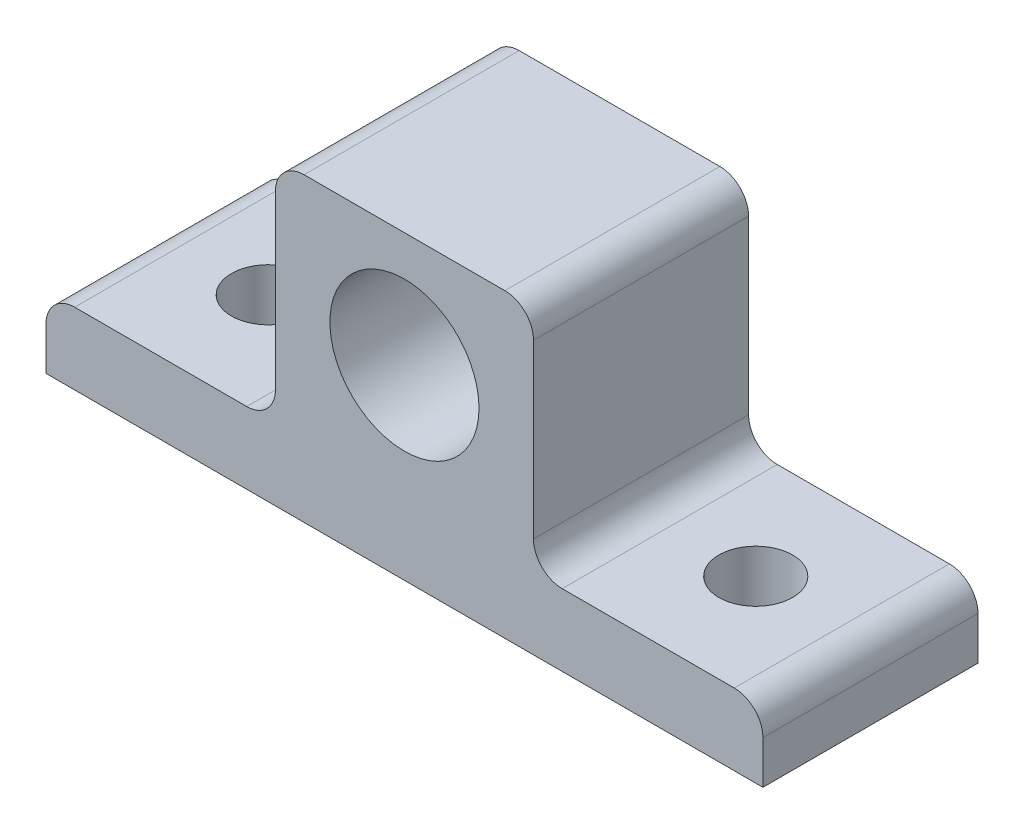
ISO-10303-21;
HEADER;
FILE_DESCRIPTION(('STEP AP214'),'2;1');
FILE_NAME('part.step','',(''),(''),'','','');
FILE_SCHEMA(('AUTOMOTIVE_DESIGN { 1 0 10303 214 1 1 1 1 }'));
ENDSEC;
DATA;
#1=APPLICATION_CONTEXT('core data for automotive mechanical design processes');
#2=APPLICATION_PROTOCOL_DEFINITION('international standard','automotive_design',2000,#1);
#3=PRODUCT_CONTEXT('',#1,'mechanical');
#4=PRODUCT('Part','Part','',(#3));
#5=PRODUCT_RELATED_PRODUCT_CATEGORY('part','',(#4));
#6=PRODUCT_DEFINITION_FORMATION('','',#4);
#7=PRODUCT_DEFINITION_CONTEXT('part definition',#1,'design');
#8=PRODUCT_DEFINITION('design','',#6,#7);
#9=PRODUCT_DEFINITION_SHAPE('','',#8);
#10=(LENGTH_UNIT() NAMED_UNIT(*) SI_UNIT(.MILLI.,.METRE.));
#11=(NAMED_UNIT(*) PLANE_ANGLE_UNIT() SI_UNIT($,.RADIAN.));
#12=(NAMED_UNIT(*) SI_UNIT($,.STERADIAN.) SOLID_ANGLE_UNIT());
#13=UNCERTAINTY_MEASURE_WITH_UNIT(LENGTH_MEASURE(1.E-05),#10,'distance_accuracy_value','');
#14=(GEOMETRIC_REPRESENTATION_CONTEXT(3) GLOBAL_UNCERTAINTY_ASSIGNED_CONTEXT((#13)) GLOBAL_UNIT_ASSIGNED_CONTEXT((#10,
#11,#12)) REPRESENTATION_CONTEXT('',''));
#15=CARTESIAN_POINT('',(0.,0.,0.));
#16=DIRECTION('',(0.,0.,1.));
#17=DIRECTION('',(1.,0.,0.));
#18=AXIS2_PLACEMENT_3D('',#15,#16,#17);
#19=CARTESIAN_POINT('',(0.,6.35,0.));
#20=DIRECTION('',(0.,1.,0.));
#21=DIRECTION('',(0.,0.,1.));
#22=AXIS2_PLACEMENT_3D('',#19,#20,#21);
#23=PLANE('',#22);
#24=DIRECTION('',(1.,0.,0.));
#25=VECTOR('',#24,1.);
#26=CARTESIAN_POINT('',(0.,6.35,15.9360907544145));
#27=LINE('',#26,#25);
#28=CARTESIAN_POINT('',(-32.8410455281497,6.35,15.9360907544145));
#29=VERTEX_POINT('',#28);
#30=CARTESIAN_POINT('',(-17.6010455281497,6.35,15.9360907544145));
#31=VERTEX_POINT('',#30);
#32=EDGE_CURVE('E206',#29,#31,#27,.T.);
#33=ORIENTED_EDGE('',*,*,#32,.T.);
#34=DIRECTION('',(0.,0.,1.));
#35=VECTOR('',#34,1.);
#36=CARTESIAN_POINT('',(-17.6010455281497,6.35,0.));
#37=LINE('',#36,#35);
#38=CARTESIAN_POINT('',(-17.6010455281497,6.35,-3.11390924558546));
#39=VERTEX_POINT('',#38);
#40=EDGE_CURVE('E225',#31,#39,#37,.F.);
#41=ORIENTED_EDGE('',*,*,#40,.T.);
#42=DIRECTION('',(1.,0.,0.));
#43=VECTOR('',#42,1.);
#44=CARTESIAN_POINT('',(0.,6.35,-3.11390924558546));
#45=LINE('',#44,#43);
#46=CARTESIAN_POINT('',(-32.8410455281497,6.35,-3.11390924558546));
#47=VERTEX_POINT('',#46);
#48=EDGE_CURVE('E220',#47,#39,#45,.T.);
#49=ORIENTED_EDGE('',*,*,#48,.F.);
#50=DIRECTION('',(0.,0.,1.));
#51=VECTOR('',#50,1.);
#52=CARTESIAN_POINT('',(-32.8410455281497,6.35,15.9360907544145));
#53=LINE('',#52,#51);
#54=EDGE_CURVE('E222',#47,#29,#53,.T.);
#55=ORIENTED_EDGE('',*,*,#54,.T.);
#56=EDGE_LOOP('',(#33,#41,#49,#55));
#57=FACE_BOUND('',#56,.T.);
#58=CARTESIAN_POINT('',(-25.2210455281497,6.35,6.41109075441454));
#59=DIRECTION('',(0.,1.,0.));
#60=DIRECTION('',(0.,0.,1.));
#61=AXIS2_PLACEMENT_3D('',#58,#59,#60);
#62=CIRCLE('',#61,3.2639);
#63=CARTESIAN_POINT('',(-25.2210455281497,6.35,9.67499075441455));
#64=VERTEX_POINT('',#63);
#65=EDGE_CURVE('E175',#64,#64,#62,.T.);
#66=ORIENTED_EDGE('',*,*,#65,.F.);
#67=EDGE_LOOP('',(#66));
#68=FACE_BOUND('',#67,.T.);
#69=ADVANCED_FACE('F36',(#57,#68),#23,.T.);
#70=CARTESIAN_POINT('',(0.,6.35,15.9360907544145));
#71=DIRECTION('',(0.,0.,-1.));
#72=DIRECTION('',(-1.,0.,0.));
#73=AXIS2_PLACEMENT_3D('',#70,#71,#72);
#74=PLANE('',#73);
#75=CARTESIAN_POINT('',(-3.63104552814974,16.51,15.9360907544145));
#76=DIRECTION('',(0.,0.,1.));
#77=DIRECTION('',(1.,0.,0.));
#78=AXIS2_PLACEMENT_3D('',#75,#76,#77);
#79=CIRCLE('',#78,6.604);
#80=CARTESIAN_POINT('',(2.97295447185026,16.51,15.9360907544145));
#81=VERTEX_POINT('',#80);
#82=EDGE_CURVE('E312',#81,#81,#79,.T.);
#83=ORIENTED_EDGE('',*,*,#82,.F.);
#84=EDGE_LOOP('',(#83));
#85=FACE_BOUND('',#84,.T.);
#86=ORIENTED_EDGE('',*,*,#32,.F.);
#87=CARTESIAN_POINT('',(-32.8410455281497,3.81,15.9360907544145));
#88=DIRECTION('',(0.,0.,-1.));
#89=DIRECTION('',(-1.,0.,0.));
#90=AXIS2_PLACEMENT_3D('',#87,#88,#89);
#91=CIRCLE('',#90,2.54);
#92=CARTESIAN_POINT('',(-35.3810455281497,3.81,15.9360907544145));
#93=VERTEX_POINT('',#92);
#94=EDGE_CURVE('E234',#29,#93,#91,.F.);
#95=ORIENTED_EDGE('',*,*,#94,.T.);
#96=DIRECTION('',(0.,-1.,0.));
#97=VECTOR('',#96,1.);
#98=CARTESIAN_POINT('',(-35.3810455281497,6.35,15.9360907544145));
#99=LINE('',#98,#97);
#100=CARTESIAN_POINT('',(-35.3810455281497,0.,15.9360907544145));
#101=VERTEX_POINT('',#100);
#102=EDGE_CURVE('E156',#93,#101,#99,.T.);
#103=ORIENTED_EDGE('',*,*,#102,.T.);
#104=DIRECTION('',(1.,0.,0.));
#105=VECTOR('',#104,1.);
#106=CARTESIAN_POINT('',(0.,0.,15.9360907544145));
#107=LINE('',#106,#105);
#108=CARTESIAN_POINT('',(28.1189544718503,0.,15.9360907544145));
#109=VERTEX_POINT('',#108);
#110=EDGE_CURVE('E152',#101,#109,#107,.T.);
#111=ORIENTED_EDGE('',*,*,#110,.T.);
#112=DIRECTION('',(0.,-1.,0.));
#113=VECTOR('',#112,1.);
#114=CARTESIAN_POINT('',(28.1189544718503,6.35,15.9360907544145));
#115=LINE('',#114,#113);
#116=CARTESIAN_POINT('',(28.1189544718503,3.81,15.9360907544145));
#117=VERTEX_POINT('',#116);
#118=EDGE_CURVE('E139',#117,#109,#115,.T.);
#119=ORIENTED_EDGE('',*,*,#118,.F.);
#120=CARTESIAN_POINT('',(25.5789544718503,3.81,15.9360907544145));
#121=DIRECTION('',(0.,0.,-1.));
#122=DIRECTION('',(-1.,0.,0.));
#123=AXIS2_PLACEMENT_3D('',#120,#121,#122);
#124=CIRCLE('',#123,2.54);
#125=CARTESIAN_POINT('',(25.5789544718503,6.35,15.9360907544145));
#126=VERTEX_POINT('',#125);
#127=EDGE_CURVE('E232',#117,#126,#124,.F.);
#128=ORIENTED_EDGE('',*,*,#127,.T.);
#129=CARTESIAN_POINT('',(10.3389544718503,6.35,15.9360907544145));
#130=VERTEX_POINT('',#129);
#131=EDGE_CURVE('E202',#130,#126,#27,.T.);
#132=ORIENTED_EDGE('',*,*,#131,.F.);
#133=CARTESIAN_POINT('',(10.3389544718503,8.89,15.9360907544145));
#134=DIRECTION('',(0.,0.,-1.));
#135=DIRECTION('',(-1.,0.,0.));
#136=AXIS2_PLACEMENT_3D('',#133,#134,#135);
#137=CIRCLE('',#136,2.54);
#138=CARTESIAN_POINT('',(7.79895447185026,8.89,15.9360907544145));
#139=VERTEX_POINT('',#138);
#140=EDGE_CURVE('E253',#130,#139,#137,.T.);
#141=ORIENTED_EDGE('',*,*,#140,.T.);
#142=DIRECTION('',(0.,-1.,0.));
#143=VECTOR('',#142,1.);
#144=CARTESIAN_POINT('',(7.79895447185026,26.67,15.9360907544145));
#145=LINE('',#144,#143);
#146=CARTESIAN_POINT('',(7.79895447185026,24.13,15.9360907544145));
#147=VERTEX_POINT('',#146);
#148=EDGE_CURVE('E190',#147,#139,#145,.T.);
#149=ORIENTED_EDGE('',*,*,#148,.F.);
#150=CARTESIAN_POINT('',(5.25895447185026,24.13,15.9360907544145));
#151=DIRECTION('',(0.,0.,-1.));
#152=DIRECTION('',(-1.,0.,0.));
#153=AXIS2_PLACEMENT_3D('',#150,#151,#152);
#154=CIRCLE('',#153,2.54);
#155=CARTESIAN_POINT('',(5.25895447185026,26.67,15.9360907544145));
#156=VERTEX_POINT('',#155);
#157=EDGE_CURVE('E230',#147,#156,#154,.F.);
#158=ORIENTED_EDGE('',*,*,#157,.T.);
#159=DIRECTION('',(1.,0.,0.));
#160=VECTOR('',#159,1.);
#161=CARTESIAN_POINT('',(-15.0610455281497,26.67,15.9360907544145));
#162=LINE('',#161,#160);
#163=CARTESIAN_POINT('',(-12.5210455281497,26.67,15.9360907544145));
#164=VERTEX_POINT('',#163);
#165=EDGE_CURVE('E276',#164,#156,#162,.T.);
#166=ORIENTED_EDGE('',*,*,#165,.F.);
#167=CARTESIAN_POINT('',(-12.5210455281497,24.13,15.9360907544145));
#168=DIRECTION('',(0.,0.,-1.));
#169=DIRECTION('',(-1.,0.,0.));
#170=AXIS2_PLACEMENT_3D('',#167,#168,#169);
#171=CIRCLE('',#170,2.54);
#172=CARTESIAN_POINT('',(-15.0610455281497,24.13,15.9360907544145));
#173=VERTEX_POINT('',#172);
#174=EDGE_CURVE('E228',#164,#173,#171,.F.);
#175=ORIENTED_EDGE('',*,*,#174,.T.);
#176=DIRECTION('',(0.,-1.,0.));
#177=VECTOR('',#176,1.);
#178=CARTESIAN_POINT('',(-15.0610455281497,26.67,15.9360907544145));
#179=LINE('',#178,#177);
#180=CARTESIAN_POINT('',(-15.0610455281497,8.89,15.9360907544145));
#181=VERTEX_POINT('',#180);
#182=EDGE_CURVE('E196',#173,#181,#179,.T.);
#183=ORIENTED_EDGE('',*,*,#182,.T.);
#184=CARTESIAN_POINT('',(-17.6010455281497,8.89,15.9360907544145));
#185=DIRECTION('',(0.,0.,-1.));
#186=DIRECTION('',(-1.,0.,0.));
#187=AXIS2_PLACEMENT_3D('',#184,#185,#186);
#188=CIRCLE('',#187,2.54);
#189=EDGE_CURVE('E44',#181,#31,#188,.T.);
#190=ORIENTED_EDGE('',*,*,#189,.T.);
#191=EDGE_LOOP('',(#86,#95,#103,#111,#119,#128,#132,#141,#149,#158,#166,#175,#183,#190));
#192=FACE_BOUND('',#191,.T.);
#193=ADVANCED_FACE('F154',(#85,#192),#74,.F.);
#194=CARTESIAN_POINT('',(28.1189544718503,6.35,0.));
#195=DIRECTION('',(1.,0.,0.));
#196=DIRECTION('',(0.,0.,-1.));
#197=AXIS2_PLACEMENT_3D('',#194,#195,#196);
#198=PLANE('',#197);
#199=DIRECTION('',(0.,-1.,0.));
#200=VECTOR('',#199,1.);
#201=CARTESIAN_POINT('',(28.1189544718503,6.35,-3.11390924558546));
#202=LINE('',#201,#200);
#203=CARTESIAN_POINT('',(28.1189544718503,3.81,-3.11390924558546));
#204=VERTEX_POINT('',#203);
#205=CARTESIAN_POINT('',(28.1189544718503,0.,-3.11390924558546));
#206=VERTEX_POINT('',#205);
#207=EDGE_CURVE('E149',#204,#206,#202,.T.);
#208=ORIENTED_EDGE('',*,*,#207,.F.);
#209=DIRECTION('',(0.,0.,1.));
#210=VECTOR('',#209,1.);
#211=CARTESIAN_POINT('',(28.1189544718503,3.81,0.));
#212=LINE('',#211,#210);
#213=EDGE_CURVE('E146',#204,#117,#212,.T.);
#214=ORIENTED_EDGE('',*,*,#213,.T.);
#215=ORIENTED_EDGE('',*,*,#118,.T.);
#216=DIRECTION('',(0.,0.,1.));
#217=VECTOR('',#216,1.);
#218=CARTESIAN_POINT('',(28.1189544718503,0.,0.));
#219=LINE('',#218,#217);
#220=EDGE_CURVE('E143',#206,#109,#219,.T.);
#221=ORIENTED_EDGE('',*,*,#220,.F.);
#222=EDGE_LOOP('',(#208,#214,#215,#221));
#223=FACE_BOUND('',#222,.T.);
#224=ADVANCED_FACE('F141',(#223),#198,.T.);
#225=CARTESIAN_POINT('',(0.,6.35,-3.11390924558546));
#226=DIRECTION('',(0.,0.,-1.));
#227=DIRECTION('',(-1.,0.,0.));
#228=AXIS2_PLACEMENT_3D('',#225,#226,#227);
#229=PLANE('',#228);
#230=CARTESIAN_POINT('',(-3.63104552814974,16.51,-3.11390924558546));
#231=DIRECTION('',(0.,0.,-1.));
#232=DIRECTION('',(-1.,0.,0.));
#233=AXIS2_PLACEMENT_3D('',#230,#231,#232);
#234=CIRCLE('',#233,6.604);
#235=CARTESIAN_POINT('',(-10.2350455281497,16.51,-3.11390924558546));
#236=VERTEX_POINT('',#235);
#237=EDGE_CURVE('E192',#236,#236,#234,.T.);
#238=ORIENTED_EDGE('',*,*,#237,.F.);
#239=EDGE_LOOP('',(#238));
#240=FACE_BOUND('',#239,.T.);
#241=DIRECTION('',(0.,-1.,0.));
#242=VECTOR('',#241,1.);
#243=CARTESIAN_POINT('',(-35.3810455281497,6.35,-3.11390924558546));
#244=LINE('',#243,#242);
#245=CARTESIAN_POINT('',(-35.3810455281497,3.81,-3.11390924558546));
#246=VERTEX_POINT('',#245);
#247=CARTESIAN_POINT('',(-35.3810455281497,0.,-3.11390924558546));
#248=VERTEX_POINT('',#247);
#249=EDGE_CURVE('E177',#246,#248,#244,.T.);
#250=ORIENTED_EDGE('',*,*,#249,.F.);
#251=CARTESIAN_POINT('',(-32.8410455281497,3.81,-3.11390924558546));
#252=DIRECTION('',(0.,0.,-1.));
#253=DIRECTION('',(-1.,0.,0.));
#254=AXIS2_PLACEMENT_3D('',#251,#252,#253);
#255=CIRCLE('',#254,2.54);
#256=EDGE_CURVE('E242',#246,#47,#255,.T.);
#257=ORIENTED_EDGE('',*,*,#256,.T.);
#258=ORIENTED_EDGE('',*,*,#48,.T.);
#259=CARTESIAN_POINT('',(-17.6010455281497,8.89,-3.11390924558546));
#260=DIRECTION('',(0.,0.,-1.));
#261=DIRECTION('',(-1.,0.,0.));
#262=AXIS2_PLACEMENT_3D('',#259,#260,#261);
#263=CIRCLE('',#262,2.54);
#264=CARTESIAN_POINT('',(-15.0610455281497,8.89,-3.11390924558546));
#265=VERTEX_POINT('',#264);
#266=EDGE_CURVE('E11',#39,#265,#263,.F.);
#267=ORIENTED_EDGE('',*,*,#266,.T.);
#268=DIRECTION('',(0.,-1.,0.));
#269=VECTOR('',#268,1.);
#270=CARTESIAN_POINT('',(-15.0610455281497,26.67,-3.11390924558546));
#271=LINE('',#270,#269);
#272=CARTESIAN_POINT('',(-15.0610455281497,24.13,-3.11390924558546));
#273=VERTEX_POINT('',#272);
#274=EDGE_CURVE('E191',#273,#265,#271,.T.);
#275=ORIENTED_EDGE('',*,*,#274,.F.);
#276=CARTESIAN_POINT('',(-12.5210455281497,24.13,-3.11390924558546));
#277=DIRECTION('',(0.,0.,-1.));
#278=DIRECTION('',(-1.,0.,0.));
#279=AXIS2_PLACEMENT_3D('',#276,#277,#278);
#280=CIRCLE('',#279,2.54);
#281=CARTESIAN_POINT('',(-12.5210455281497,26.67,-3.11390924558546));
#282=VERTEX_POINT('',#281);
#283=EDGE_CURVE('E58',#273,#282,#280,.T.);
#284=ORIENTED_EDGE('',*,*,#283,.T.);
#285=DIRECTION('',(-1.,0.,0.));
#286=VECTOR('',#285,1.);
#287=CARTESIAN_POINT('',(-15.0610455281497,26.67,-3.11390924558546));
#288=LINE('',#287,#286);
#289=CARTESIAN_POINT('',(5.25895447185025,26.67,-3.11390924558546));
#290=VERTEX_POINT('',#289);
#291=EDGE_CURVE('E274',#290,#282,#288,.T.);
#292=ORIENTED_EDGE('',*,*,#291,.F.);
#293=CARTESIAN_POINT('',(5.25895447185026,24.13,-3.11390924558546));
#294=DIRECTION('',(0.,0.,-1.));
#295=DIRECTION('',(-1.,0.,0.));
#296=AXIS2_PLACEMENT_3D('',#293,#294,#295);
#297=CIRCLE('',#296,2.54);
#298=CARTESIAN_POINT('',(7.79895447185026,24.13,-3.11390924558546));
#299=VERTEX_POINT('',#298);
#300=EDGE_CURVE('E239',#290,#299,#297,.T.);
#301=ORIENTED_EDGE('',*,*,#300,.T.);
#302=DIRECTION('',(0.,-1.,0.));
#303=VECTOR('',#302,1.);
#304=CARTESIAN_POINT('',(7.79895447185026,26.67,-3.11390924558546));
#305=LINE('',#304,#303);
#306=CARTESIAN_POINT('',(7.79895447185026,8.89,-3.11390924558546));
#307=VERTEX_POINT('',#306);
#308=EDGE_CURVE('E186',#299,#307,#305,.T.);
#309=ORIENTED_EDGE('',*,*,#308,.T.);
#310=CARTESIAN_POINT('',(10.3389544718503,8.89,-3.11390924558546));
#311=DIRECTION('',(0.,0.,-1.));
#312=DIRECTION('',(-1.,0.,0.));
#313=AXIS2_PLACEMENT_3D('',#310,#311,#312);
#314=CIRCLE('',#313,2.54);
#315=CARTESIAN_POINT('',(10.3389544718503,6.35,-3.11390924558546));
#316=VERTEX_POINT('',#315);
#317=EDGE_CURVE('E251',#307,#316,#314,.F.);
#318=ORIENTED_EDGE('',*,*,#317,.T.);
#319=CARTESIAN_POINT('',(25.5789544718503,6.35,-3.11390924558546));
#320=VERTEX_POINT('',#319);
#321=EDGE_CURVE('E207',#316,#320,#45,.T.);
#322=ORIENTED_EDGE('',*,*,#321,.T.);
#323=CARTESIAN_POINT('',(25.5789544718503,3.81,-3.11390924558546));
#324=DIRECTION('',(0.,0.,-1.));
#325=DIRECTION('',(-1.,0.,0.));
#326=AXIS2_PLACEMENT_3D('',#323,#324,#325);
#327=CIRCLE('',#326,2.54);
#328=EDGE_CURVE('E51',#320,#204,#327,.T.);
#329=ORIENTED_EDGE('',*,*,#328,.T.);
#330=ORIENTED_EDGE('',*,*,#207,.T.);
#331=DIRECTION('',(1.,0.,0.));
#332=VECTOR('',#331,1.);
#333=CARTESIAN_POINT('',(0.,0.,-3.11390924558546));
#334=LINE('',#333,#332);
#335=EDGE_CURVE('E165',#248,#206,#334,.T.);
#336=ORIENTED_EDGE('',*,*,#335,.F.);
#337=EDGE_LOOP('',(#250,#257,#258,#267,#275,#284,#292,#301,#309,#318,#322,#329,#330,#336));
#338=FACE_BOUND('',#337,.T.);
#339=ADVANCED_FACE('F269',(#240,#338),#229,.T.);
#340=CARTESIAN_POINT('',(-35.3810455281497,6.35,0.));
#341=DIRECTION('',(1.,0.,0.));
#342=DIRECTION('',(0.,0.,-1.));
#343=AXIS2_PLACEMENT_3D('',#340,#341,#342);
#344=PLANE('',#343);
#345=ORIENTED_EDGE('',*,*,#102,.F.);
#346=DIRECTION('',(0.,0.,1.));
#347=VECTOR('',#346,1.);
#348=CARTESIAN_POINT('',(-35.3810455281497,3.81,-3.11390924558546));
#349=LINE('',#348,#347);
#350=EDGE_CURVE('E236',#93,#246,#349,.F.);
#351=ORIENTED_EDGE('',*,*,#350,.T.);
#352=ORIENTED_EDGE('',*,*,#249,.T.);
#353=DIRECTION('',(0.,0.,1.));
#354=VECTOR('',#353,1.);
#355=CARTESIAN_POINT('',(-35.3810455281497,0.,0.));
#356=LINE('',#355,#354);
#357=EDGE_CURVE('E167',#248,#101,#356,.T.);
#358=ORIENTED_EDGE('',*,*,#357,.T.);
#359=EDGE_LOOP('',(#345,#351,#352,#358));
#360=FACE_BOUND('',#359,.T.);
#361=ADVANCED_FACE('F333',(#360),#344,.F.);
#362=CARTESIAN_POINT('',(-25.2210455281497,6.35,6.41109075441454));
#363=DIRECTION('',(0.,-1.,0.));
#364=DIRECTION('',(0.,0.,-1.));
#365=AXIS2_PLACEMENT_3D('',#362,#363,#364);
#366=CYLINDRICAL_SURFACE('',#365,3.2639);
#367=ORIENTED_EDGE('',*,*,#65,.T.);
#368=EDGE_LOOP('',(#367));
#369=FACE_BOUND('',#368,.T.);
#370=CARTESIAN_POINT('',(-25.2210455281497,0.,6.41109075441454));
#371=DIRECTION('',(0.,1.,0.));
#372=DIRECTION('',(0.,0.,1.));
#373=AXIS2_PLACEMENT_3D('',#370,#371,#372);
#374=CIRCLE('',#373,3.2639);
#375=CARTESIAN_POINT('',(-25.2210455281497,0.,9.67499075441455));
#376=VERTEX_POINT('',#375);
#377=EDGE_CURVE('E160',#376,#376,#374,.T.);
#378=ORIENTED_EDGE('',*,*,#377,.F.);
#379=EDGE_LOOP('',(#378));
#380=FACE_BOUND('',#379,.T.);
#381=ADVANCED_FACE('F329',(#369,#380),#366,.F.);
#382=CARTESIAN_POINT('',(17.9589544718503,6.35,6.41109075441454));
#383=DIRECTION('',(0.,-1.,0.));
#384=DIRECTION('',(0.,0.,-1.));
#385=AXIS2_PLACEMENT_3D('',#382,#383,#384);
#386=CYLINDRICAL_SURFACE('',#385,3.26390000000001);
#387=CARTESIAN_POINT('',(17.9589544718503,6.35,6.41109075441454));
#388=DIRECTION('',(0.,1.,0.));
#389=DIRECTION('',(0.,0.,1.));
#390=AXIS2_PLACEMENT_3D('',#387,#388,#389);
#391=CIRCLE('',#390,3.26390000000001);
#392=CARTESIAN_POINT('',(17.9589544718503,6.35,9.67499075441455));
#393=VERTEX_POINT('',#392);
#394=EDGE_CURVE('E178',#393,#393,#391,.T.);
#395=ORIENTED_EDGE('',*,*,#394,.T.);
#396=EDGE_LOOP('',(#395));
#397=FACE_BOUND('',#396,.T.);
#398=CARTESIAN_POINT('',(17.9589544718503,0.,6.41109075441454));
#399=DIRECTION('',(0.,1.,0.));
#400=DIRECTION('',(0.,0.,1.));
#401=AXIS2_PLACEMENT_3D('',#398,#399,#400);
#402=CIRCLE('',#401,3.26390000000001);
#403=CARTESIAN_POINT('',(17.9589544718503,0.,9.67499075441455));
#404=VERTEX_POINT('',#403);
#405=EDGE_CURVE('E172',#404,#404,#402,.T.);
#406=ORIENTED_EDGE('',*,*,#405,.F.);
#407=EDGE_LOOP('',(#406));
#408=FACE_BOUND('',#407,.T.);
#409=ADVANCED_FACE('F332',(#397,#408),#386,.F.);
#410=ORIENTED_EDGE('',*,*,#321,.F.);
#411=DIRECTION('',(0.,0.,-1.));
#412=VECTOR('',#411,1.);
#413=CARTESIAN_POINT('',(10.3389544718503,6.35,0.));
#414=LINE('',#413,#412);
#415=EDGE_CURVE('E282',#316,#130,#414,.F.);
#416=ORIENTED_EDGE('',*,*,#415,.T.);
#417=ORIENTED_EDGE('',*,*,#131,.T.);
#418=DIRECTION('',(0.,0.,1.));
#419=VECTOR('',#418,1.);
#420=CARTESIAN_POINT('',(25.5789544718503,6.35,0.));
#421=LINE('',#420,#419);
#422=EDGE_CURVE('E201',#126,#320,#421,.F.);
#423=ORIENTED_EDGE('',*,*,#422,.T.);
#424=EDGE_LOOP('',(#410,#416,#417,#423));
#425=FACE_BOUND('',#424,.T.);
#426=ORIENTED_EDGE('',*,*,#394,.F.);
#427=EDGE_LOOP('',(#426));
#428=FACE_BOUND('',#427,.T.);
#429=ADVANCED_FACE('F288',(#425,#428),#23,.T.);
#430=CARTESIAN_POINT('',(0.,0.,0.));
#431=DIRECTION('',(0.,1.,0.));
#432=DIRECTION('',(0.,0.,1.));
#433=AXIS2_PLACEMENT_3D('',#430,#431,#432);
#434=PLANE('',#433);
#435=ORIENTED_EDGE('',*,*,#377,.T.);
#436=EDGE_LOOP('',(#435));
#437=FACE_BOUND('',#436,.T.);
#438=ORIENTED_EDGE('',*,*,#110,.F.);
#439=ORIENTED_EDGE('',*,*,#357,.F.);
#440=ORIENTED_EDGE('',*,*,#335,.T.);
#441=ORIENTED_EDGE('',*,*,#220,.T.);
#442=EDGE_LOOP('',(#438,#439,#440,#441));
#443=FACE_BOUND('',#442,.T.);
#444=ORIENTED_EDGE('',*,*,#405,.T.);
#445=EDGE_LOOP('',(#444));
#446=FACE_BOUND('',#445,.T.);
#447=ADVANCED_FACE('F162',(#437,#443,#446),#434,.F.);
#448=CARTESIAN_POINT('',(-15.0610455281497,26.67,15.9360907544145));
#449=DIRECTION('',(1.,0.,0.));
#450=DIRECTION('',(0.,0.,-1.));
#451=AXIS2_PLACEMENT_3D('',#448,#449,#450);
#452=PLANE('',#451);
#453=ORIENTED_EDGE('',*,*,#274,.T.);
#454=DIRECTION('',(0.,0.,1.));
#455=VECTOR('',#454,1.);
#456=CARTESIAN_POINT('',(-15.0610455281497,8.89,15.9360907544145));
#457=LINE('',#456,#455);
#458=EDGE_CURVE('E226',#265,#181,#457,.T.);
#459=ORIENTED_EDGE('',*,*,#458,.T.);
#460=ORIENTED_EDGE('',*,*,#182,.F.);
#461=DIRECTION('',(0.,0.,1.));
#462=VECTOR('',#461,1.);
#463=CARTESIAN_POINT('',(-15.0610455281497,24.13,15.9360907544145));
#464=LINE('',#463,#462);
#465=EDGE_CURVE('E273',#173,#273,#464,.F.);
#466=ORIENTED_EDGE('',*,*,#465,.T.);
#467=EDGE_LOOP('',(#453,#459,#460,#466));
#468=FACE_BOUND('',#467,.T.);
#469=ADVANCED_FACE('F271',(#468),#452,.F.);
#470=CARTESIAN_POINT('',(7.79895447185026,26.67,15.9360907544145));
#471=DIRECTION('',(-1.,0.,0.));
#472=DIRECTION('',(0.,0.,1.));
#473=AXIS2_PLACEMENT_3D('',#470,#471,#472);
#474=PLANE('',#473);
#475=ORIENTED_EDGE('',*,*,#148,.T.);
#476=DIRECTION('',(0.,0.,-1.));
#477=VECTOR('',#476,1.);
#478=CARTESIAN_POINT('',(7.79895447185026,8.89,15.9360907544145));
#479=LINE('',#478,#477);
#480=EDGE_CURVE('E198',#139,#307,#479,.T.);
#481=ORIENTED_EDGE('',*,*,#480,.T.);
#482=ORIENTED_EDGE('',*,*,#308,.F.);
#483=DIRECTION('',(0.,0.,-1.));
#484=VECTOR('',#483,1.);
#485=CARTESIAN_POINT('',(7.79895447185026,24.13,15.9360907544145));
#486=LINE('',#485,#484);
#487=EDGE_CURVE('E148',#299,#147,#486,.F.);
#488=ORIENTED_EDGE('',*,*,#487,.T.);
#489=EDGE_LOOP('',(#475,#481,#482,#488));
#490=FACE_BOUND('',#489,.T.);
#491=ADVANCED_FACE('F299',(#490),#474,.F.);
#492=CARTESIAN_POINT('',(0.,26.67,0.));
#493=DIRECTION('',(0.,-1.,0.));
#494=DIRECTION('',(0.,0.,-1.));
#495=AXIS2_PLACEMENT_3D('',#492,#493,#494);
#496=PLANE('',#495);
#497=ORIENTED_EDGE('',*,*,#165,.T.);
#498=DIRECTION('',(0.,0.,-1.));
#499=VECTOR('',#498,1.);
#500=CARTESIAN_POINT('',(5.25895447185026,26.67,0.));
#501=LINE('',#500,#499);
#502=EDGE_CURVE('E248',#156,#290,#501,.T.);
#503=ORIENTED_EDGE('',*,*,#502,.T.);
#504=ORIENTED_EDGE('',*,*,#291,.T.);
#505=DIRECTION('',(0.,0.,1.));
#506=VECTOR('',#505,1.);
#507=CARTESIAN_POINT('',(-12.5210455281497,26.67,0.));
#508=LINE('',#507,#506);
#509=EDGE_CURVE('E245',#282,#164,#508,.T.);
#510=ORIENTED_EDGE('',*,*,#509,.T.);
#511=EDGE_LOOP('',(#497,#503,#504,#510));
#512=FACE_BOUND('',#511,.T.);
#513=ADVANCED_FACE('F307',(#512),#496,.F.);
#514=CARTESIAN_POINT('',(-3.63104552814974,16.51,-4.38390924558546));
#515=DIRECTION('',(0.,0.,1.));
#516=DIRECTION('',(1.,0.,0.));
#517=AXIS2_PLACEMENT_3D('',#514,#515,#516);
#518=CYLINDRICAL_SURFACE('',#517,6.604);
#519=ORIENTED_EDGE('',*,*,#237,.T.);
#520=EDGE_LOOP('',(#519));
#521=FACE_BOUND('',#520,.T.);
#522=ORIENTED_EDGE('',*,*,#82,.T.);
#523=EDGE_LOOP('',(#522));
#524=FACE_BOUND('',#523,.T.);
#525=ADVANCED_FACE('F317',(#521,#524),#518,.F.);
#526=CARTESIAN_POINT('',(10.3389544718503,8.89,15.9360907544145));
#527=DIRECTION('',(0.,0.,-1.));
#528=DIRECTION('',(-1.,0.,0.));
#529=AXIS2_PLACEMENT_3D('',#526,#527,#528);
#530=CYLINDRICAL_SURFACE('',#529,2.54);
#531=ORIENTED_EDGE('',*,*,#140,.F.);
#532=ORIENTED_EDGE('',*,*,#415,.F.);
#533=ORIENTED_EDGE('',*,*,#317,.F.);
#534=ORIENTED_EDGE('',*,*,#480,.F.);
#535=EDGE_LOOP('',(#531,#532,#533,#534));
#536=FACE_BOUND('',#535,.T.);
#537=ADVANCED_FACE('F296',(#536),#530,.F.);
#538=CARTESIAN_POINT('',(-17.6010455281497,8.89,15.9360907544145));
#539=DIRECTION('',(0.,0.,1.));
#540=DIRECTION('',(1.,0.,0.));
#541=AXIS2_PLACEMENT_3D('',#538,#539,#540);
#542=CYLINDRICAL_SURFACE('',#541,2.54);
#543=ORIENTED_EDGE('',*,*,#266,.F.);
#544=ORIENTED_EDGE('',*,*,#40,.F.);
#545=ORIENTED_EDGE('',*,*,#189,.F.);
#546=ORIENTED_EDGE('',*,*,#458,.F.);
#547=EDGE_LOOP('',(#543,#544,#545,#546));
#548=FACE_BOUND('',#547,.T.);
#549=ADVANCED_FACE('F266',(#548),#542,.F.);
#550=CARTESIAN_POINT('',(-32.8410455281497,3.81,0.));
#551=DIRECTION('',(0.,0.,-1.));
#552=DIRECTION('',(-1.,0.,0.));
#553=AXIS2_PLACEMENT_3D('',#550,#551,#552);
#554=CYLINDRICAL_SURFACE('',#553,2.54);
#555=ORIENTED_EDGE('',*,*,#256,.F.);
#556=ORIENTED_EDGE('',*,*,#350,.F.);
#557=ORIENTED_EDGE('',*,*,#94,.F.);
#558=ORIENTED_EDGE('',*,*,#54,.F.);
#559=EDGE_LOOP('',(#555,#556,#557,#558));
#560=FACE_BOUND('',#559,.T.);
#561=ADVANCED_FACE('F339',(#560),#554,.T.);
#562=CARTESIAN_POINT('',(25.5789544718503,3.81,0.));
#563=DIRECTION('',(0.,0.,1.));
#564=DIRECTION('',(1.,0.,0.));
#565=AXIS2_PLACEMENT_3D('',#562,#563,#564);
#566=CYLINDRICAL_SURFACE('',#565,2.54);
#567=ORIENTED_EDGE('',*,*,#328,.F.);
#568=ORIENTED_EDGE('',*,*,#422,.F.);
#569=ORIENTED_EDGE('',*,*,#127,.F.);
#570=ORIENTED_EDGE('',*,*,#213,.F.);
#571=EDGE_LOOP('',(#567,#568,#569,#570));
#572=FACE_BOUND('',#571,.T.);
#573=ADVANCED_FACE('F291',(#572),#566,.T.);
#574=CARTESIAN_POINT('',(5.25895447185026,24.13,0.));
#575=DIRECTION('',(0.,0.,-1.));
#576=DIRECTION('',(-1.,0.,0.));
#577=AXIS2_PLACEMENT_3D('',#574,#575,#576);
#578=CYLINDRICAL_SURFACE('',#577,2.54);
#579=ORIENTED_EDGE('',*,*,#157,.F.);
#580=ORIENTED_EDGE('',*,*,#487,.F.);
#581=ORIENTED_EDGE('',*,*,#300,.F.);
#582=ORIENTED_EDGE('',*,*,#502,.F.);
#583=EDGE_LOOP('',(#579,#580,#581,#582));
#584=FACE_BOUND('',#583,.T.);
#585=ADVANCED_FACE('F304',(#584),#578,.T.);
#586=CARTESIAN_POINT('',(-12.5210455281497,24.13,0.));
#587=DIRECTION('',(0.,0.,1.));
#588=DIRECTION('',(1.,0.,0.));
#589=AXIS2_PLACEMENT_3D('',#586,#587,#588);
#590=CYLINDRICAL_SURFACE('',#589,2.54);
#591=ORIENTED_EDGE('',*,*,#283,.F.);
#592=ORIENTED_EDGE('',*,*,#465,.F.);
#593=ORIENTED_EDGE('',*,*,#174,.F.);
#594=ORIENTED_EDGE('',*,*,#509,.F.);
#595=EDGE_LOOP('',(#591,#592,#593,#594));
#596=FACE_BOUND('',#595,.T.);
#597=ADVANCED_FACE('F38',(#596),#590,.T.);
#598=CLOSED_SHELL('',(#69,#193,#224,#339,#361,#381,#409,#429,#447,#469,#491,#513,#525,#537,#549,
#561,#573,#585,#597));
#599=MANIFOLD_SOLID_BREP('B2',#598);
#600=ADVANCED_BREP_SHAPE_REPRESENTATION('',(#18,#599),#14);
#601=SHAPE_DEFINITION_REPRESENTATION(#9,#600);
ENDSEC;
END-ISO-10303-21;
